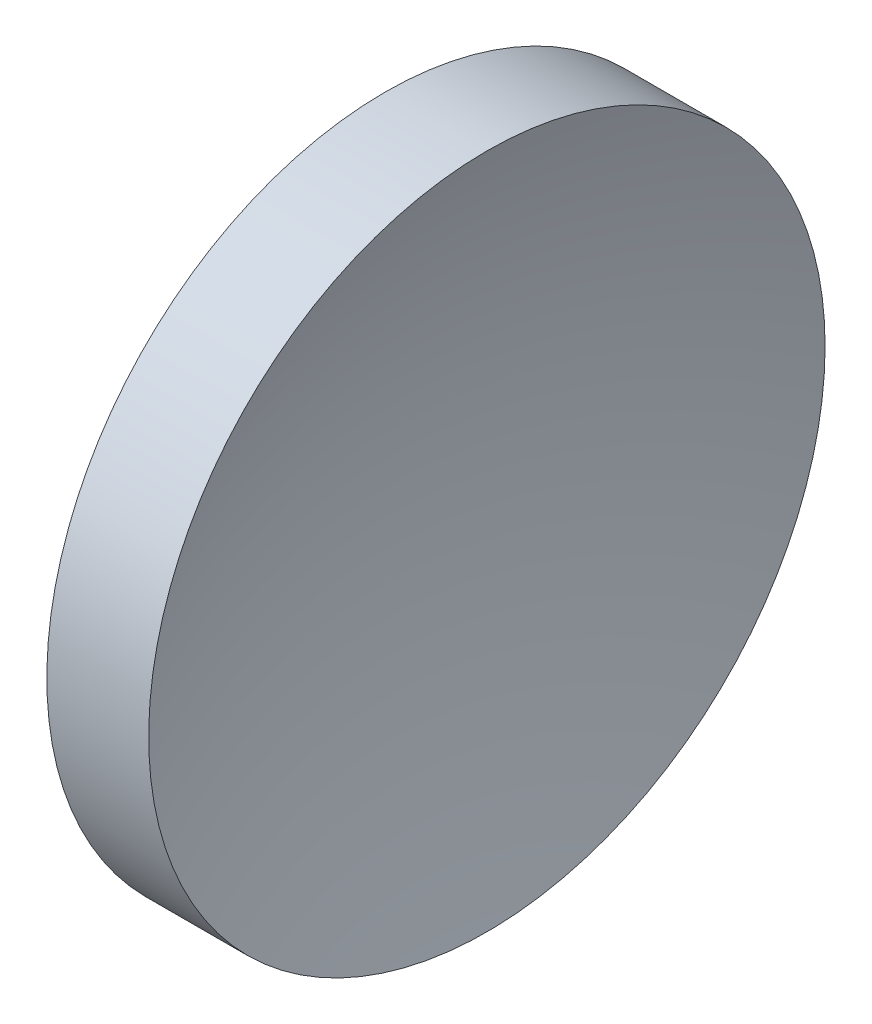
ISO-10303-21;
HEADER;
FILE_DESCRIPTION(('STEP AP214'),'2;1');
FILE_NAME('part.step','',(''),(''),'','','');
FILE_SCHEMA(('AUTOMOTIVE_DESIGN { 1 0 10303 214 1 1 1 1 }'));
ENDSEC;
DATA;
#1=APPLICATION_CONTEXT('core data for automotive mechanical design processes');
#2=APPLICATION_PROTOCOL_DEFINITION('international standard','automotive_design',2000,#1);
#3=PRODUCT_CONTEXT('',#1,'mechanical');
#4=PRODUCT('Part','Part','',(#3));
#5=PRODUCT_RELATED_PRODUCT_CATEGORY('part','',(#4));
#6=PRODUCT_DEFINITION_FORMATION('','',#4);
#7=PRODUCT_DEFINITION_CONTEXT('part definition',#1,'design');
#8=PRODUCT_DEFINITION('design','',#6,#7);
#9=PRODUCT_DEFINITION_SHAPE('','',#8);
#10=(LENGTH_UNIT() NAMED_UNIT(*) SI_UNIT(.MILLI.,.METRE.));
#11=(NAMED_UNIT(*) PLANE_ANGLE_UNIT() SI_UNIT($,.RADIAN.));
#12=(NAMED_UNIT(*) SI_UNIT($,.STERADIAN.) SOLID_ANGLE_UNIT());
#13=UNCERTAINTY_MEASURE_WITH_UNIT(LENGTH_MEASURE(1.E-05),#10,'distance_accuracy_value','');
#14=(GEOMETRIC_REPRESENTATION_CONTEXT(3) GLOBAL_UNCERTAINTY_ASSIGNED_CONTEXT((#13)) GLOBAL_UNIT_ASSIGNED_CONTEXT((#10,
#11,#12)) REPRESENTATION_CONTEXT('',''));
#15=CARTESIAN_POINT('',(0.,0.,0.));
#16=DIRECTION('',(0.,0.,1.));
#17=DIRECTION('',(1.,0.,0.));
#18=AXIS2_PLACEMENT_3D('',#15,#16,#17);
#19=CARTESIAN_POINT('',(-6.85447984423315,34.5168962409161,22.1552279145953));
#20=DIRECTION('',(1.,0.,0.));
#21=DIRECTION('',(0.,1.,0.));
#22=AXIS2_PLACEMENT_3D('',#19,#20,#21);
#23=SPHERICAL_SURFACE('',#22,77.7000000000001);
#24=CARTESIAN_POINT('',(-80.285604035546,34.5168962409161,22.1552279145953));
#25=DIRECTION('',(1.,0.,0.));
#26=DIRECTION('',(0.,0.,-1.));
#27=AXIS2_PLACEMENT_3D('',#24,#25,#26);
#28=CIRCLE('',#27,25.4);
#29=CARTESIAN_POINT('',(-80.285604035546,34.5168962409161,-3.24477208540466));
#30=VERTEX_POINT('',#29);
#31=EDGE_CURVE('E8',#30,#30,#28,.T.);
#32=ORIENTED_EDGE('',*,*,#31,.T.);
#33=EDGE_LOOP('',(#32));
#34=FACE_BOUND('',#33,.T.);
#35=ADVANCED_FACE('F13',(#34),#23,.F.);
#36=CARTESIAN_POINT('',(-84.5544798442333,34.5168962409161,22.1552279145953));
#37=DIRECTION('',(1.,0.,0.));
#38=DIRECTION('',(0.,0.,-1.));
#39=AXIS2_PLACEMENT_3D('',#36,#37,#38);
#40=CYLINDRICAL_SURFACE('',#39,25.4);
#41=CARTESIAN_POINT('',(-87.9350232450416,34.5168962409161,22.1552279145953));
#42=DIRECTION('',(1.,0.,0.));
#43=DIRECTION('',(0.,0.,-1.));
#44=AXIS2_PLACEMENT_3D('',#41,#42,#43);
#45=CIRCLE('',#44,25.4);
#46=CARTESIAN_POINT('',(-87.9350232450416,34.5168962409161,-3.24477208540469));
#47=VERTEX_POINT('',#46);
#48=EDGE_CURVE('E19',#47,#47,#45,.T.);
#49=ORIENTED_EDGE('',*,*,#48,.T.);
#50=EDGE_LOOP('',(#49));
#51=FACE_BOUND('',#50,.T.);
#52=ORIENTED_EDGE('',*,*,#31,.F.);
#53=EDGE_LOOP('',(#52));
#54=FACE_BOUND('',#53,.T.);
#55=ADVANCED_FACE('F25',(#51,#54),#40,.T.);
#56=CARTESIAN_POINT('',(110.445520155767,34.5168962409161,22.1552279145953));
#57=DIRECTION('',(1.,0.,0.));
#58=DIRECTION('',(0.,1.,0.));
#59=AXIS2_PLACEMENT_3D('',#56,#57,#58);
#60=SPHERICAL_SURFACE('',#59,200.);
#61=ORIENTED_EDGE('',*,*,#48,.F.);
#62=EDGE_LOOP('',(#61));
#63=FACE_BOUND('',#62,.T.);
#64=ADVANCED_FACE('F28',(#63),#60,.T.);
#65=CLOSED_SHELL('',(#35,#55,#64));
#66=MANIFOLD_SOLID_BREP('B1',#65);
#67=ADVANCED_BREP_SHAPE_REPRESENTATION('',(#18,#66),#14);
#68=SHAPE_DEFINITION_REPRESENTATION(#9,#67);
ENDSEC;
END-ISO-10303-21;
